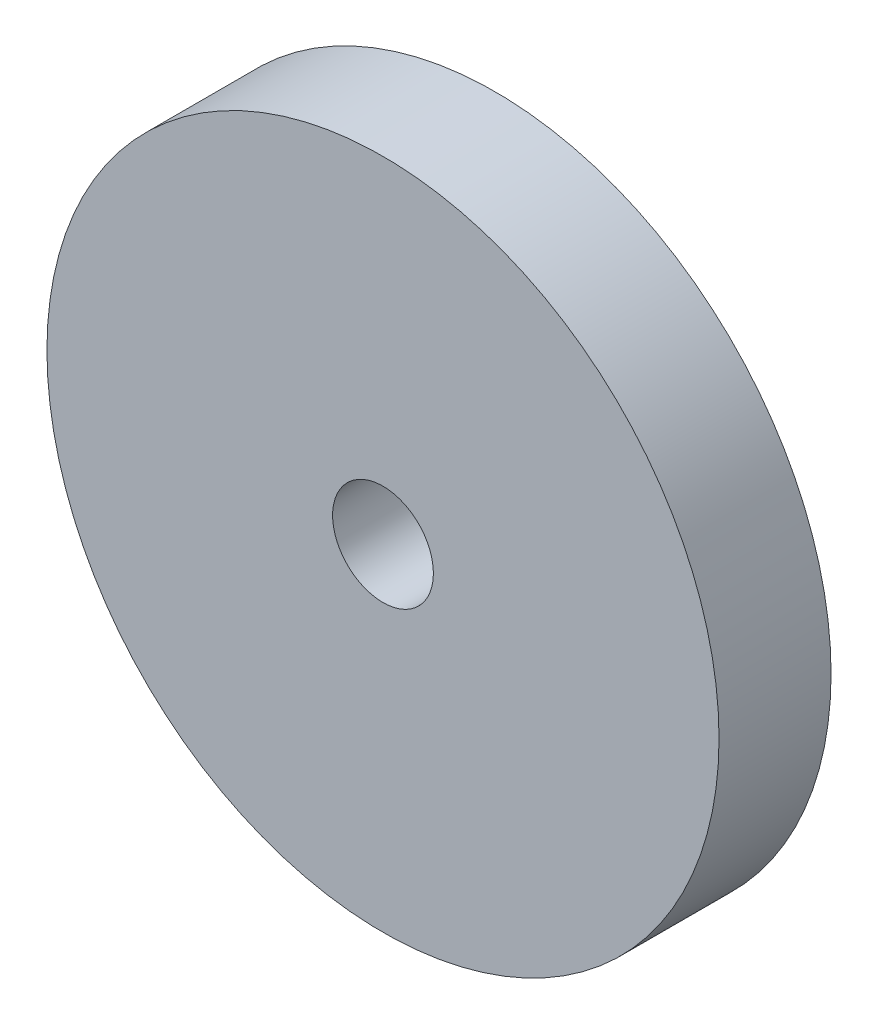
ISO-10303-21;
HEADER;
FILE_DESCRIPTION(('STEP AP214'),'2;1');
FILE_NAME('part.step','',(''),(''),'','','');
FILE_SCHEMA(('AUTOMOTIVE_DESIGN { 1 0 10303 214 1 1 1 1 }'));
ENDSEC;
DATA;
#1=APPLICATION_CONTEXT('core data for automotive mechanical design processes');
#2=APPLICATION_PROTOCOL_DEFINITION('international standard','automotive_design',2000,#1);
#3=PRODUCT_CONTEXT('',#1,'mechanical');
#4=PRODUCT('Part','Part','',(#3));
#5=PRODUCT_RELATED_PRODUCT_CATEGORY('part','',(#4));
#6=PRODUCT_DEFINITION_FORMATION('','',#4);
#7=PRODUCT_DEFINITION_CONTEXT('part definition',#1,'design');
#8=PRODUCT_DEFINITION('design','',#6,#7);
#9=PRODUCT_DEFINITION_SHAPE('','',#8);
#10=(LENGTH_UNIT() NAMED_UNIT(*) SI_UNIT(.MILLI.,.METRE.));
#11=(NAMED_UNIT(*) PLANE_ANGLE_UNIT() SI_UNIT($,.RADIAN.));
#12=(NAMED_UNIT(*) SI_UNIT($,.STERADIAN.) SOLID_ANGLE_UNIT());
#13=UNCERTAINTY_MEASURE_WITH_UNIT(LENGTH_MEASURE(1.E-05),#10,'distance_accuracy_value','');
#14=(GEOMETRIC_REPRESENTATION_CONTEXT(3) GLOBAL_UNCERTAINTY_ASSIGNED_CONTEXT((#13)) GLOBAL_UNIT_ASSIGNED_CONTEXT((#10,
#11,#12)) REPRESENTATION_CONTEXT('',''));
#15=CARTESIAN_POINT('',(0.,0.,0.));
#16=DIRECTION('',(0.,0.,1.));
#17=DIRECTION('',(1.,0.,0.));
#18=AXIS2_PLACEMENT_3D('',#15,#16,#17);
#19=CARTESIAN_POINT('',(0.,0.,20.));
#20=DIRECTION('',(0.,0.,1.));
#21=DIRECTION('',(1.,0.,0.));
#22=AXIS2_PLACEMENT_3D('',#19,#20,#21);
#23=PLANE('',#22);
#24=CARTESIAN_POINT('',(0.,0.,20.));
#25=DIRECTION('',(0.,0.,1.));
#26=DIRECTION('',(1.,0.,0.));
#27=AXIS2_PLACEMENT_3D('',#24,#25,#26);
#28=CIRCLE('',#27,60.);
#29=CARTESIAN_POINT('',(60.,0.,20.));
#30=VERTEX_POINT('',#29);
#31=EDGE_CURVE('E10',#30,#30,#28,.T.);
#32=ORIENTED_EDGE('',*,*,#31,.T.);
#33=EDGE_LOOP('',(#32));
#34=FACE_BOUND('',#33,.T.);
#35=CARTESIAN_POINT('',(0.,0.,20.));
#36=DIRECTION('',(0.,0.,1.));
#37=DIRECTION('',(1.,0.,0.));
#38=AXIS2_PLACEMENT_3D('',#35,#36,#37);
#39=CIRCLE('',#38,9.);
#40=CARTESIAN_POINT('',(9.,0.,20.));
#41=VERTEX_POINT('',#40);
#42=EDGE_CURVE('E41',#41,#41,#39,.T.);
#43=ORIENTED_EDGE('',*,*,#42,.F.);
#44=EDGE_LOOP('',(#43));
#45=FACE_BOUND('',#44,.T.);
#46=ADVANCED_FACE('F30',(#34,#45),#23,.T.);
#47=CARTESIAN_POINT('',(0.,0.,0.));
#48=DIRECTION('',(0.,0.,1.));
#49=DIRECTION('',(1.,0.,0.));
#50=AXIS2_PLACEMENT_3D('',#47,#48,#49);
#51=PLANE('',#50);
#52=CARTESIAN_POINT('',(0.,0.,0.));
#53=DIRECTION('',(0.,0.,1.));
#54=DIRECTION('',(1.,0.,0.));
#55=AXIS2_PLACEMENT_3D('',#52,#53,#54);
#56=CIRCLE('',#55,60.);
#57=CARTESIAN_POINT('',(60.,0.,0.));
#58=VERTEX_POINT('',#57);
#59=EDGE_CURVE('E34',#58,#58,#56,.T.);
#60=ORIENTED_EDGE('',*,*,#59,.F.);
#61=EDGE_LOOP('',(#60));
#62=FACE_BOUND('',#61,.T.);
#63=CARTESIAN_POINT('',(0.,0.,0.));
#64=DIRECTION('',(0.,0.,1.));
#65=DIRECTION('',(1.,0.,0.));
#66=AXIS2_PLACEMENT_3D('',#63,#64,#65);
#67=CIRCLE('',#66,9.);
#68=CARTESIAN_POINT('',(9.,0.,0.));
#69=VERTEX_POINT('',#68);
#70=EDGE_CURVE('E43',#69,#69,#67,.T.);
#71=ORIENTED_EDGE('',*,*,#70,.T.);
#72=EDGE_LOOP('',(#71));
#73=FACE_BOUND('',#72,.T.);
#74=ADVANCED_FACE('F53',(#62,#73),#51,.F.);
#75=CARTESIAN_POINT('',(0.,0.,20.));
#76=DIRECTION('',(0.,0.,-1.));
#77=DIRECTION('',(-1.,0.,0.));
#78=AXIS2_PLACEMENT_3D('',#75,#76,#77);
#79=CYLINDRICAL_SURFACE('',#78,60.);
#80=ORIENTED_EDGE('',*,*,#31,.F.);
#81=EDGE_LOOP('',(#80));
#82=FACE_BOUND('',#81,.T.);
#83=ORIENTED_EDGE('',*,*,#59,.T.);
#84=EDGE_LOOP('',(#83));
#85=FACE_BOUND('',#84,.T.);
#86=ADVANCED_FACE('F32',(#82,#85),#79,.T.);
#87=CARTESIAN_POINT('',(0.,0.,20.));
#88=DIRECTION('',(0.,0.,-1.));
#89=DIRECTION('',(-1.,0.,0.));
#90=AXIS2_PLACEMENT_3D('',#87,#88,#89);
#91=CYLINDRICAL_SURFACE('',#90,9.);
#92=ORIENTED_EDGE('',*,*,#42,.T.);
#93=EDGE_LOOP('',(#92));
#94=FACE_BOUND('',#93,.T.);
#95=ORIENTED_EDGE('',*,*,#70,.F.);
#96=EDGE_LOOP('',(#95));
#97=FACE_BOUND('',#96,.T.);
#98=ADVANCED_FACE('F49',(#94,#97),#91,.F.);
#99=CLOSED_SHELL('',(#46,#74,#86,#98));
#100=MANIFOLD_SOLID_BREP('B2',#99);
#101=ADVANCED_BREP_SHAPE_REPRESENTATION('',(#18,#100),#14);
#102=SHAPE_DEFINITION_REPRESENTATION(#9,#101);
ENDSEC;
END-ISO-10303-21;
